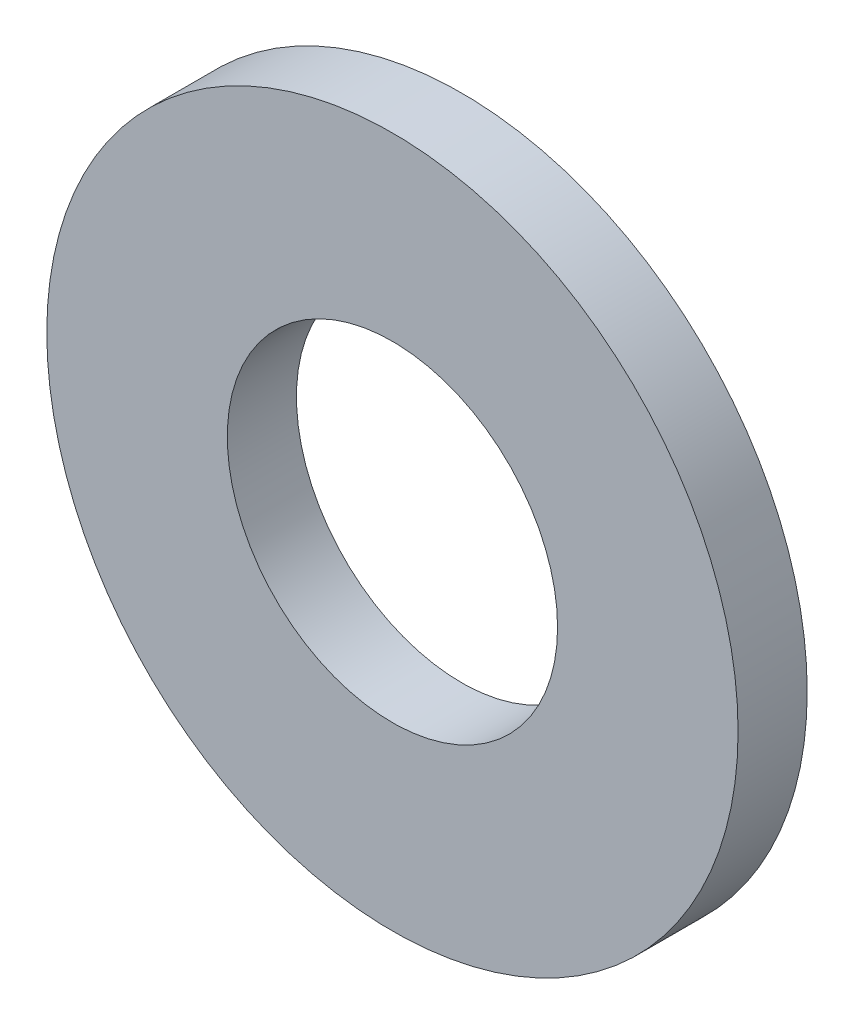
ISO-10303-21;
HEADER;
FILE_DESCRIPTION(('STEP AP214'),'2;1');
FILE_NAME('part.step','',(''),(''),'','','');
FILE_SCHEMA(('AUTOMOTIVE_DESIGN { 1 0 10303 214 1 1 1 1 }'));
ENDSEC;
DATA;
#1=APPLICATION_CONTEXT('core data for automotive mechanical design processes');
#2=APPLICATION_PROTOCOL_DEFINITION('international standard','automotive_design',2000,#1);
#3=PRODUCT_CONTEXT('',#1,'mechanical');
#4=PRODUCT('Part','Part','',(#3));
#5=PRODUCT_RELATED_PRODUCT_CATEGORY('part','',(#4));
#6=PRODUCT_DEFINITION_FORMATION('','',#4);
#7=PRODUCT_DEFINITION_CONTEXT('part definition',#1,'design');
#8=PRODUCT_DEFINITION('design','',#6,#7);
#9=PRODUCT_DEFINITION_SHAPE('','',#8);
#10=(LENGTH_UNIT() NAMED_UNIT(*) SI_UNIT(.MILLI.,.METRE.));
#11=(NAMED_UNIT(*) PLANE_ANGLE_UNIT() SI_UNIT($,.RADIAN.));
#12=(NAMED_UNIT(*) SI_UNIT($,.STERADIAN.) SOLID_ANGLE_UNIT());
#13=UNCERTAINTY_MEASURE_WITH_UNIT(LENGTH_MEASURE(1.E-05),#10,'distance_accuracy_value','');
#14=(GEOMETRIC_REPRESENTATION_CONTEXT(3) GLOBAL_UNCERTAINTY_ASSIGNED_CONTEXT((#13)) GLOBAL_UNIT_ASSIGNED_CONTEXT((#10,
#11,#12)) REPRESENTATION_CONTEXT('',''));
#15=CARTESIAN_POINT('',(0.,0.,0.));
#16=DIRECTION('',(0.,0.,1.));
#17=DIRECTION('',(1.,0.,0.));
#18=AXIS2_PLACEMENT_3D('',#15,#16,#17);
#19=CARTESIAN_POINT('',(0.,0.,0.9));
#20=DIRECTION('',(0.,0.,1.));
#21=DIRECTION('',(1.,0.,0.));
#22=AXIS2_PLACEMENT_3D('',#19,#20,#21);
#23=PLANE('',#22);
#24=CARTESIAN_POINT('',(0.,0.,0.9));
#25=DIRECTION('',(0.,0.,1.));
#26=DIRECTION('',(1.,0.,0.));
#27=AXIS2_PLACEMENT_3D('',#24,#25,#26);
#28=CIRCLE('',#27,4.5);
#29=CARTESIAN_POINT('',(4.5,0.,0.9));
#30=VERTEX_POINT('',#29);
#31=EDGE_CURVE('E10',#30,#30,#28,.T.);
#32=ORIENTED_EDGE('',*,*,#31,.T.);
#33=EDGE_LOOP('',(#32));
#34=FACE_BOUND('',#33,.T.);
#35=CARTESIAN_POINT('',(0.,0.,0.9));
#36=DIRECTION('',(0.,0.,1.));
#37=DIRECTION('',(1.,0.,0.));
#38=AXIS2_PLACEMENT_3D('',#35,#36,#37);
#39=CIRCLE('',#38,2.15);
#40=CARTESIAN_POINT('',(2.15,0.,0.9));
#41=VERTEX_POINT('',#40);
#42=EDGE_CURVE('E48',#41,#41,#39,.T.);
#43=ORIENTED_EDGE('',*,*,#42,.F.);
#44=EDGE_LOOP('',(#43));
#45=FACE_BOUND('',#44,.T.);
#46=ADVANCED_FACE('F37',(#34,#45),#23,.T.);
#47=CARTESIAN_POINT('',(0.,0.,0.));
#48=DIRECTION('',(0.,0.,1.));
#49=DIRECTION('',(1.,0.,0.));
#50=AXIS2_PLACEMENT_3D('',#47,#48,#49);
#51=PLANE('',#50);
#52=CARTESIAN_POINT('',(0.,0.,0.));
#53=DIRECTION('',(0.,0.,1.));
#54=DIRECTION('',(1.,0.,0.));
#55=AXIS2_PLACEMENT_3D('',#52,#53,#54);
#56=CIRCLE('',#55,4.5);
#57=CARTESIAN_POINT('',(4.5,0.,0.));
#58=VERTEX_POINT('',#57);
#59=EDGE_CURVE('E41',#58,#58,#56,.T.);
#60=ORIENTED_EDGE('',*,*,#59,.F.);
#61=EDGE_LOOP('',(#60));
#62=FACE_BOUND('',#61,.T.);
#63=CARTESIAN_POINT('',(0.,0.,0.));
#64=DIRECTION('',(0.,0.,1.));
#65=DIRECTION('',(1.,0.,0.));
#66=AXIS2_PLACEMENT_3D('',#63,#64,#65);
#67=CIRCLE('',#66,2.15);
#68=CARTESIAN_POINT('',(2.15,0.,0.));
#69=VERTEX_POINT('',#68);
#70=EDGE_CURVE('E50',#69,#69,#67,.T.);
#71=ORIENTED_EDGE('',*,*,#70,.T.);
#72=EDGE_LOOP('',(#71));
#73=FACE_BOUND('',#72,.T.);
#74=ADVANCED_FACE('F60',(#62,#73),#51,.F.);
#75=CARTESIAN_POINT('',(0.,0.,0.9));
#76=DIRECTION('',(0.,0.,-1.));
#77=DIRECTION('',(-1.,0.,0.));
#78=AXIS2_PLACEMENT_3D('',#75,#76,#77);
#79=CYLINDRICAL_SURFACE('',#78,4.5);
#80=ORIENTED_EDGE('',*,*,#31,.F.);
#81=EDGE_LOOP('',(#80));
#82=FACE_BOUND('',#81,.T.);
#83=ORIENTED_EDGE('',*,*,#59,.T.);
#84=EDGE_LOOP('',(#83));
#85=FACE_BOUND('',#84,.T.);
#86=ADVANCED_FACE('F39',(#82,#85),#79,.T.);
#87=CARTESIAN_POINT('',(0.,0.,0.9));
#88=DIRECTION('',(0.,0.,-1.));
#89=DIRECTION('',(-1.,0.,0.));
#90=AXIS2_PLACEMENT_3D('',#87,#88,#89);
#91=CYLINDRICAL_SURFACE('',#90,2.15);
#92=ORIENTED_EDGE('',*,*,#42,.T.);
#93=EDGE_LOOP('',(#92));
#94=FACE_BOUND('',#93,.T.);
#95=ORIENTED_EDGE('',*,*,#70,.F.);
#96=EDGE_LOOP('',(#95));
#97=FACE_BOUND('',#96,.T.);
#98=ADVANCED_FACE('F56',(#94,#97),#91,.F.);
#99=CLOSED_SHELL('',(#46,#74,#86,#98));
#100=MANIFOLD_SOLID_BREP('B2',#99);
#101=ADVANCED_BREP_SHAPE_REPRESENTATION('',(#18,#100),#14);
#102=SHAPE_DEFINITION_REPRESENTATION(#9,#101);
ENDSEC;
END-ISO-10303-21;
